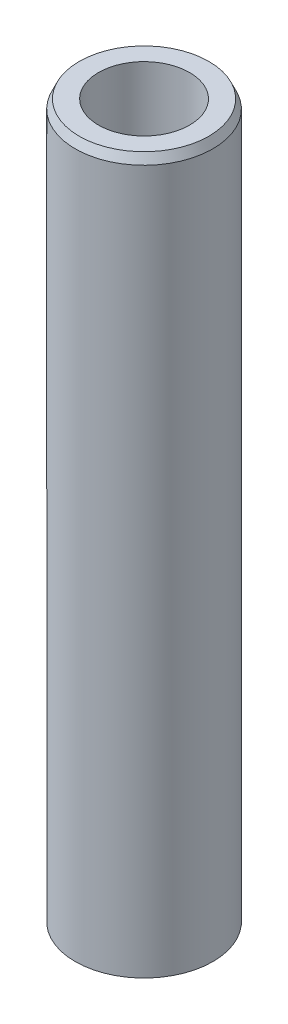
ISO-10303-21;
HEADER;
FILE_DESCRIPTION(('STEP AP214'),'2;1');
FILE_NAME('part.step','',(''),(''),'','','');
FILE_SCHEMA(('AUTOMOTIVE_DESIGN { 1 0 10303 214 1 1 1 1 }'));
ENDSEC;
DATA;
#1=APPLICATION_CONTEXT('core data for automotive mechanical design processes');
#2=APPLICATION_PROTOCOL_DEFINITION('international standard','automotive_design',2000,#1);
#3=PRODUCT_CONTEXT('',#1,'mechanical');
#4=PRODUCT('Part','Part','',(#3));
#5=PRODUCT_RELATED_PRODUCT_CATEGORY('part','',(#4));
#6=PRODUCT_DEFINITION_FORMATION('','',#4);
#7=PRODUCT_DEFINITION_CONTEXT('part definition',#1,'design');
#8=PRODUCT_DEFINITION('design','',#6,#7);
#9=PRODUCT_DEFINITION_SHAPE('','',#8);
#10=(LENGTH_UNIT() NAMED_UNIT(*) SI_UNIT(.MILLI.,.METRE.));
#11=(NAMED_UNIT(*) PLANE_ANGLE_UNIT() SI_UNIT($,.RADIAN.));
#12=(NAMED_UNIT(*) SI_UNIT($,.STERADIAN.) SOLID_ANGLE_UNIT());
#13=UNCERTAINTY_MEASURE_WITH_UNIT(LENGTH_MEASURE(1.E-05),#10,'distance_accuracy_value','');
#14=(GEOMETRIC_REPRESENTATION_CONTEXT(3) GLOBAL_UNCERTAINTY_ASSIGNED_CONTEXT((#13)) GLOBAL_UNIT_ASSIGNED_CONTEXT((#10,
#11,#12)) REPRESENTATION_CONTEXT('',''));
#15=CARTESIAN_POINT('',(0.,0.,0.));
#16=DIRECTION('',(0.,0.,1.));
#17=DIRECTION('',(1.,0.,0.));
#18=AXIS2_PLACEMENT_3D('',#15,#16,#17);
#19=CARTESIAN_POINT('',(0.,312.295103270512,0.));
#20=DIRECTION('',(0.,-1.,0.));
#21=DIRECTION('',(0.,0.,-1.));
#22=AXIS2_PLACEMENT_3D('',#19,#20,#21);
#23=CYLINDRICAL_SURFACE('',#22,30.);
#24=CARTESIAN_POINT('',(0.,308.427922616235,0.));
#25=DIRECTION('',(0.,1.,0.));
#26=DIRECTION('',(0.,0.,1.));
#27=AXIS2_PLACEMENT_3D('',#24,#25,#26);
#28=CIRCLE('',#27,30.);
#29=CARTESIAN_POINT('',(0.,308.427922616235,-30.));
#30=VERTEX_POINT('',#29);
#31=EDGE_CURVE('E50',#30,#30,#28,.F.);
#32=CARTESIAN_POINT('',(0.,1.76509483110665,0.));
#33=DIRECTION('',(0.,1.,0.));
#34=DIRECTION('',(0.,0.,1.));
#35=AXIS2_PLACEMENT_3D('',#32,#33,#34);
#36=CIRCLE('',#35,30.);
#37=CARTESIAN_POINT('',(0.,1.76509483110665,-30.));
#38=VERTEX_POINT('',#37);
#39=EDGE_CURVE('E51',#38,#38,#36,.T.);
#40=CARTESIAN_POINT('',(0.,308.427922616235,-30.));
#41=CARTESIAN_POINT('',(0.,305.23351816014,-30.));
#42=CARTESIAN_POINT('',(0.,302.039113704044,-30.));
#43=CARTESIAN_POINT('',(0.,295.650304791854,-30.));
#44=CARTESIAN_POINT('',(0.,292.455900335759,-30.));
#45=CARTESIAN_POINT('',(0.,286.067091423569,-30.));
#46=CARTESIAN_POINT('',(0.,282.872686967474,-30.));
#47=CARTESIAN_POINT('',(0.,276.483878055284,-30.));
#48=CARTESIAN_POINT('',(0.,273.289473599189,-30.));
#49=CARTESIAN_POINT('',(0.,266.900664686999,-30.));
#50=CARTESIAN_POINT('',(0.,263.706260230903,-30.));
#51=CARTESIAN_POINT('',(0.,257.317451318713,-30.));
#52=CARTESIAN_POINT('',(0.,254.123046862618,-30.));
#53=CARTESIAN_POINT('',(0.,247.734237950428,-30.));
#54=CARTESIAN_POINT('',(0.,244.539833494333,-30.));
#55=CARTESIAN_POINT('',(0.,238.151024582143,-30.));
#56=CARTESIAN_POINT('',(0.,234.956620126048,-30.));
#57=CARTESIAN_POINT('',(0.,228.567811213858,-30.));
#58=CARTESIAN_POINT('',(0.,225.373406757762,-30.));
#59=CARTESIAN_POINT('',(0.,218.984597845572,-30.));
#60=CARTESIAN_POINT('',(0.,215.790193389477,-30.));
#61=CARTESIAN_POINT('',(0.,209.401384477287,-30.));
#62=CARTESIAN_POINT('',(0.,206.206980021192,-30.));
#63=CARTESIAN_POINT('',(0.,199.818171109002,-30.));
#64=CARTESIAN_POINT('',(0.,196.623766652907,-30.));
#65=CARTESIAN_POINT('',(0.,190.234957740717,-30.));
#66=CARTESIAN_POINT('',(0.,187.040553284621,-30.));
#67=CARTESIAN_POINT('',(0.,180.651744372431,-30.));
#68=CARTESIAN_POINT('',(0.,177.457339916336,-30.));
#69=CARTESIAN_POINT('',(0.,171.068531004146,-30.));
#70=CARTESIAN_POINT('',(0.,167.874126548051,-30.));
#71=CARTESIAN_POINT('',(0.,161.485317635861,-30.));
#72=CARTESIAN_POINT('',(0.,158.290913179766,-30.));
#73=CARTESIAN_POINT('',(0.,151.902104267576,-30.));
#74=CARTESIAN_POINT('',(0.,148.70769981148,-30.));
#75=CARTESIAN_POINT('',(0.,142.31889089929,-30.));
#76=CARTESIAN_POINT('',(0.,139.124486443195,-30.));
#77=CARTESIAN_POINT('',(0.,132.735677531005,-30.));
#78=CARTESIAN_POINT('',(0.,129.54127307491,-30.));
#79=CARTESIAN_POINT('',(0.,123.15246416272,-30.));
#80=CARTESIAN_POINT('',(0.,119.958059706625,-30.));
#81=CARTESIAN_POINT('',(0.,113.569250794435,-30.));
#82=CARTESIAN_POINT('',(0.,110.374846338339,-30.));
#83=CARTESIAN_POINT('',(0.,103.986037426149,-30.));
#84=CARTESIAN_POINT('',(0.,100.791632970054,-30.));
#85=CARTESIAN_POINT('',(0.,94.4028240578641,-30.));
#86=CARTESIAN_POINT('',(0.,91.208419601769,-30.));
#87=CARTESIAN_POINT('',(0.,84.8196106895788,-30.));
#88=CARTESIAN_POINT('',(0.,81.6252062334837,-30.));
#89=CARTESIAN_POINT('',(0.,75.2363973212936,-30.));
#90=CARTESIAN_POINT('',(0.,72.0419928651985,-30.));
#91=CARTESIAN_POINT('',(0.,65.6531839530083,-30.));
#92=CARTESIAN_POINT('',(0.,62.4587794969132,-30.));
#93=CARTESIAN_POINT('',(0.,56.0699705847231,-30.));
#94=CARTESIAN_POINT('',(0.,52.875566128628,-30.));
#95=CARTESIAN_POINT('',(0.,46.4867572164378,-30.));
#96=CARTESIAN_POINT('',(0.,43.2923527603427,-30.));
#97=CARTESIAN_POINT('',(0.,36.9035438481526,-30.));
#98=CARTESIAN_POINT('',(0.,33.7091393920575,-30.));
#99=CARTESIAN_POINT('',(0.,27.3203304798673,-30.));
#100=CARTESIAN_POINT('',(0.,24.1259260237722,-30.));
#101=CARTESIAN_POINT('',(0.,17.7371171115821,-30.));
#102=CARTESIAN_POINT('',(0.,14.542712655487,-30.));
#103=CARTESIAN_POINT('',(0.,8.15390374329683,-30.));
#104=CARTESIAN_POINT('',(0.,4.95949928720174,-30.));
#105=CARTESIAN_POINT('',(0.,1.76509483110665,-30.));
#106=B_SPLINE_CURVE_WITH_KNOTS('',3,(#40,#41,#42,#43,#44,#45,#46,#47,#48,#49,#50,#51,#52,#53,
#54,#55,#56,#57,#58,#59,#60,#61,#62,#63,#64,#65,#66,#67,#68,#69,#70,#71,#72,#73,#74,#75,#76,#77,
#78,#79,#80,#81,#82,#83,#84,#85,#86,#87,#88,#89,#90,#91,#92,#93,#94,#95,#96,#97,#98,#99,#100,
#101,#102,#103,#104,#105),.UNSPECIFIED.,.F.,.F.,(4,2,2,2,2,2,2,2,2,2,2,2,2,2,2,2,2,2,2,2,2,2,2,
2,2,2,2,2,2,2,2,2,4),(0.,9.58321336828521,19.1664267365705,28.7496401048557,38.332853473141,
47.9160668414262,57.4992802097115,67.0824935779967,76.6657069462819,86.2489203145672,
95.8321336828525,105.415347051138,114.998560419423,124.581773787708,134.164987155993,
143.748200524279,153.331413892564,162.914627260849,172.497840629134,182.08105399742,
191.664267365705,201.24748073399,210.830694102275,220.413907470561,229.997120838846,
239.580334207131,249.163547575416,258.746760943702,268.329974311987,277.913187680272,
287.496401048557,297.079614416843,306.662827785128),.UNSPECIFIED.);
#107=EDGE_CURVE('BSEAM39',#30,#38,#106,.T.);
#108=ORIENTED_EDGE('',*,*,#31,.T.);
#109=ORIENTED_EDGE('',*,*,#39,.T.);
#110=ORIENTED_EDGE('',*,*,#107,.T.);
#111=ORIENTED_EDGE('',*,*,#107,.F.);
#112=EDGE_LOOP('',(#108,#110,#109,#111));
#113=FACE_BOUND('',#112,.T.);
#114=ADVANCED_FACE('F39',(#113),#23,.T.);
#115=CARTESIAN_POINT('',(0.,312.295103270512,0.));
#116=DIRECTION('',(0.,1.,0.));
#117=DIRECTION('',(0.,0.,1.));
#118=AXIS2_PLACEMENT_3D('',#115,#116,#117);
#119=PLANE('',#118);
#120=CARTESIAN_POINT('',(0.,312.295103270512,0.));
#121=DIRECTION('',(0.,1.,0.));
#122=DIRECTION('',(0.,0.,1.));
#123=AXIS2_PLACEMENT_3D('',#120,#121,#122);
#124=CIRCLE('',#123,28.2349051688937);
#125=CARTESIAN_POINT('',(0.,312.295103270512,28.2349051688937));
#126=VERTEX_POINT('',#125);
#127=EDGE_CURVE('E54',#126,#126,#124,.T.);
#128=ORIENTED_EDGE('',*,*,#127,.T.);
#129=EDGE_LOOP('',(#128));
#130=FACE_BOUND('',#129,.T.);
#131=CARTESIAN_POINT('',(0.,312.295103270512,0.));
#132=DIRECTION('',(0.,1.,0.));
#133=DIRECTION('',(0.,0.,1.));
#134=AXIS2_PLACEMENT_3D('',#131,#132,#133);
#135=CIRCLE('',#134,19.8548403582537);
#136=CARTESIAN_POINT('',(0.,312.295103270512,-19.8548403582537));
#137=VERTEX_POINT('',#136);
#138=EDGE_CURVE('E58',#137,#137,#135,.T.);
#139=ORIENTED_EDGE('',*,*,#138,.F.);
#140=EDGE_LOOP('',(#139));
#141=FACE_BOUND('',#140,.T.);
#142=ADVANCED_FACE('F69',(#130,#141),#119,.T.);
#143=CARTESIAN_POINT('',(0.,0.,0.));
#144=DIRECTION('',(0.,1.,0.));
#145=DIRECTION('',(0.,0.,1.));
#146=AXIS2_PLACEMENT_3D('',#143,#144,#145);
#147=PLANE('',#146);
#148=CARTESIAN_POINT('',(0.,0.,0.));
#149=DIRECTION('',(0.,1.,0.));
#150=DIRECTION('',(0.,0.,1.));
#151=AXIS2_PLACEMENT_3D('',#148,#149,#150);
#152=CIRCLE('',#151,26.1328193457223);
#153=CARTESIAN_POINT('',(0.,0.,26.1328193457223));
#154=VERTEX_POINT('',#153);
#155=EDGE_CURVE('E10',#154,#154,#152,.F.);
#156=ORIENTED_EDGE('',*,*,#155,.T.);
#157=EDGE_LOOP('',(#156));
#158=FACE_BOUND('',#157,.T.);
#159=CARTESIAN_POINT('',(0.,0.,0.));
#160=DIRECTION('',(0.,1.,0.));
#161=DIRECTION('',(0.,0.,1.));
#162=AXIS2_PLACEMENT_3D('',#159,#160,#161);
#163=CIRCLE('',#162,19.8548403582537);
#164=CARTESIAN_POINT('',(0.,0.,-19.8548403582537));
#165=VERTEX_POINT('',#164);
#166=EDGE_CURVE('E63',#165,#165,#163,.T.);
#167=ORIENTED_EDGE('',*,*,#166,.T.);
#168=EDGE_LOOP('',(#167));
#169=FACE_BOUND('',#168,.T.);
#170=ADVANCED_FACE('F75',(#158,#169),#147,.F.);
#171=CARTESIAN_POINT('',(0.,312.295103270512,0.));
#172=DIRECTION('',(0.,-1.,0.));
#173=DIRECTION('',(0.,0.,-1.));
#174=AXIS2_PLACEMENT_3D('',#171,#172,#173);
#175=CYLINDRICAL_SURFACE('',#174,19.8548403582537);
#176=CARTESIAN_POINT('',(0.,312.295103270512,-19.8548403582537));
#177=CARTESIAN_POINT('',(0.,309.04202927811,-19.8548403582537));
#178=CARTESIAN_POINT('',(0.,305.788955285709,-19.8548403582537));
#179=CARTESIAN_POINT('',(0.,299.282807300907,-19.8548403582537));
#180=CARTESIAN_POINT('',(0.,296.029733308506,-19.8548403582537));
#181=CARTESIAN_POINT('',(0.,289.523585323703,-19.8548403582537));
#182=CARTESIAN_POINT('',(0.,286.270511331302,-19.8548403582537));
#183=CARTESIAN_POINT('',(0.,279.7643633465,-19.8548403582537));
#184=CARTESIAN_POINT('',(0.,276.511289354099,-19.8548403582537));
#185=CARTESIAN_POINT('',(0.,270.005141369296,-19.8548403582537));
#186=CARTESIAN_POINT('',(0.,266.752067376895,-19.8548403582537));
#187=CARTESIAN_POINT('',(0.,260.245919392093,-19.8548403582537));
#188=CARTESIAN_POINT('',(0.,256.992845399692,-19.8548403582537));
#189=CARTESIAN_POINT('',(0.,250.48669741489,-19.8548403582537));
#190=CARTESIAN_POINT('',(0.,247.233623422488,-19.8548403582537));
#191=CARTESIAN_POINT('',(0.,240.727475437686,-19.8548403582537));
#192=CARTESIAN_POINT('',(0.,237.474401445285,-19.8548403582537));
#193=CARTESIAN_POINT('',(0.,230.968253460483,-19.8548403582537));
#194=CARTESIAN_POINT('',(0.,227.715179468081,-19.8548403582537));
#195=CARTESIAN_POINT('',(0.,221.209031483279,-19.8548403582537));
#196=CARTESIAN_POINT('',(0.,217.955957490878,-19.8548403582537));
#197=CARTESIAN_POINT('',(0.,211.449809506076,-19.8548403582537));
#198=CARTESIAN_POINT('',(0.,208.196735513674,-19.8548403582537));
#199=CARTESIAN_POINT('',(0.,201.690587528872,-19.8548403582537));
#200=CARTESIAN_POINT('',(0.,198.437513536471,-19.8548403582537));
#201=CARTESIAN_POINT('',(0.,191.931365551669,-19.8548403582537));
#202=CARTESIAN_POINT('',(0.,188.678291559267,-19.8548403582537));
#203=CARTESIAN_POINT('',(0.,182.172143574465,-19.8548403582537));
#204=CARTESIAN_POINT('',(0.,178.919069582064,-19.8548403582537));
#205=CARTESIAN_POINT('',(0.,172.412921597262,-19.8548403582537));
#206=CARTESIAN_POINT('',(0.,169.15984760486,-19.8548403582537));
#207=CARTESIAN_POINT('',(0.,162.653699620058,-19.8548403582537));
#208=CARTESIAN_POINT('',(0.,159.400625627657,-19.8548403582537));
#209=CARTESIAN_POINT('',(0.,152.894477642855,-19.8548403582537));
#210=CARTESIAN_POINT('',(0.,149.641403650453,-19.8548403582537));
#211=CARTESIAN_POINT('',(0.,143.135255665651,-19.8548403582537));
#212=CARTESIAN_POINT('',(0.,139.88218167325,-19.8548403582537));
#213=CARTESIAN_POINT('',(0.,133.376033688448,-19.8548403582537));
#214=CARTESIAN_POINT('',(0.,130.122959696047,-19.8548403582537));
#215=CARTESIAN_POINT('',(0.,123.616811711244,-19.8548403582537));
#216=CARTESIAN_POINT('',(0.,120.363737718843,-19.8548403582537));
#217=CARTESIAN_POINT('',(0.,113.857589734041,-19.8548403582537));
#218=CARTESIAN_POINT('',(0.,110.60451574164,-19.8548403582537));
#219=CARTESIAN_POINT('',(0.,104.098367756837,-19.8548403582537));
#220=CARTESIAN_POINT('',(0.,100.845293764436,-19.8548403582537));
#221=CARTESIAN_POINT('',(0.,94.3391457796337,-19.8548403582537));
#222=CARTESIAN_POINT('',(0.,91.0860717872326,-19.8548403582537));
#223=CARTESIAN_POINT('',(0.,84.5799238024302,-19.8548403582537));
#224=CARTESIAN_POINT('',(0.,81.3268498100291,-19.8548403582537));
#225=CARTESIAN_POINT('',(0.,74.8207018252267,-19.8548403582537));
#226=CARTESIAN_POINT('',(0.,71.5676278328256,-19.8548403582537));
#227=CARTESIAN_POINT('',(0.,65.0614798480233,-19.8548403582537));
#228=CARTESIAN_POINT('',(0.,61.8084058556221,-19.8548403582537));
#229=CARTESIAN_POINT('',(0.,55.3022578708198,-19.8548403582537));
#230=CARTESIAN_POINT('',(0.,52.0491838784186,-19.8548403582537));
#231=CARTESIAN_POINT('',(0.,45.5430358936163,-19.8548403582537));
#232=CARTESIAN_POINT('',(0.,42.2899619012151,-19.8548403582537));
#233=CARTESIAN_POINT('',(0.,35.7838139164128,-19.8548403582537));
#234=CARTESIAN_POINT('',(0.,32.5307399240116,-19.8548403582537));
#235=CARTESIAN_POINT('',(0.,26.0245919392093,-19.8548403582537));
#236=CARTESIAN_POINT('',(0.,22.7715179468081,-19.8548403582537));
#237=CARTESIAN_POINT('',(0.,16.2653699620058,-19.8548403582537));
#238=CARTESIAN_POINT('',(0.,13.0122959696046,-19.8548403582537));
#239=CARTESIAN_POINT('',(0.,6.50614798480231,-19.8548403582537));
#240=CARTESIAN_POINT('',(0.,3.25307399240115,-19.8548403582537));
#241=CARTESIAN_POINT('',(0.,0.,-19.8548403582537));
#242=B_SPLINE_CURVE_WITH_KNOTS('',3,(#176,#177,#178,#179,#180,#181,#182,#183,#184,#185,#186,
#187,#188,#189,#190,#191,#192,#193,#194,#195,#196,#197,#198,#199,#200,#201,#202,#203,#204,#205,
#206,#207,#208,#209,#210,#211,#212,#213,#214,#215,#216,#217,#218,#219,#220,#221,#222,#223,#224,
#225,#226,#227,#228,#229,#230,#231,#232,#233,#234,#235,#236,#237,#238,#239,#240,#241),
.UNSPECIFIED.,.F.,.F.,(4,2,2,2,2,2,2,2,2,2,2,2,2,2,2,2,2,2,2,2,2,2,2,2,2,2,2,2,2,2,2,2,4),(0.,
9.75922197720347,19.5184439544069,29.2776659316104,39.0368879088139,48.7961098860174,
58.5553318632209,68.3145538404244,78.0737758176279,87.8329977948313,97.5922197720349,
107.351441749238,117.110663726442,126.869885703645,136.629107680849,146.388329658052,
156.147551635256,165.906773612459,175.665995589663,185.425217566866,195.18443954407,
204.943661521273,214.702883498477,224.46210547568,234.221327452884,243.980549430087,
253.739771407291,263.498993384494,273.258215361698,283.017437338901,292.776659316105,
302.535881293308,312.295103270512),.UNSPECIFIED.);
#243=EDGE_CURVE('BSEAM70',#137,#165,#242,.T.);
#244=ORIENTED_EDGE('',*,*,#138,.T.);
#245=ORIENTED_EDGE('',*,*,#166,.F.);
#246=ORIENTED_EDGE('',*,*,#243,.T.);
#247=ORIENTED_EDGE('',*,*,#243,.F.);
#248=EDGE_LOOP('',(#244,#246,#245,#247));
#249=FACE_BOUND('',#248,.T.);
#250=ADVANCED_FACE('F70',(#249),#175,.F.);
#251=CARTESIAN_POINT('',(0.,312.295103270512,0.));
#252=DIRECTION('',(0.,-1.,0.));
#253=DIRECTION('',(0.,0.,-1.));
#254=AXIS2_PLACEMENT_3D('',#251,#252,#253);
#255=CONICAL_SURFACE('',#254,28.2349051688937,0.428187712072938);
#256=ORIENTED_EDGE('',*,*,#31,.F.);
#257=EDGE_LOOP('',(#256));
#258=FACE_BOUND('',#257,.T.);
#259=ORIENTED_EDGE('',*,*,#127,.F.);
#260=EDGE_LOOP('',(#259));
#261=FACE_BOUND('',#260,.T.);
#262=ADVANCED_FACE('F81',(#258,#261),#255,.T.);
#263=CARTESIAN_POINT('',(0.,1.7650948311066,0.));
#264=DIRECTION('',(0.,1.,0.));
#265=DIRECTION('',(0.,0.,1.));
#266=AXIS2_PLACEMENT_3D('',#263,#264,#265);
#267=CONICAL_SURFACE('',#266,30.,1.14260861472196);
#268=ORIENTED_EDGE('',*,*,#155,.F.);
#269=EDGE_LOOP('',(#268));
#270=FACE_BOUND('',#269,.T.);
#271=ORIENTED_EDGE('',*,*,#39,.F.);
#272=EDGE_LOOP('',(#271));
#273=FACE_BOUND('',#272,.T.);
#274=ADVANCED_FACE('F45',(#270,#273),#267,.T.);
#275=CLOSED_SHELL('',(#114,#142,#170,#250,#262,#274));
#276=MANIFOLD_SOLID_BREP('B2',#275);
#277=ADVANCED_BREP_SHAPE_REPRESENTATION('',(#18,#276),#14);
#278=SHAPE_DEFINITION_REPRESENTATION(#9,#277);
ENDSEC;
END-ISO-10303-21;
